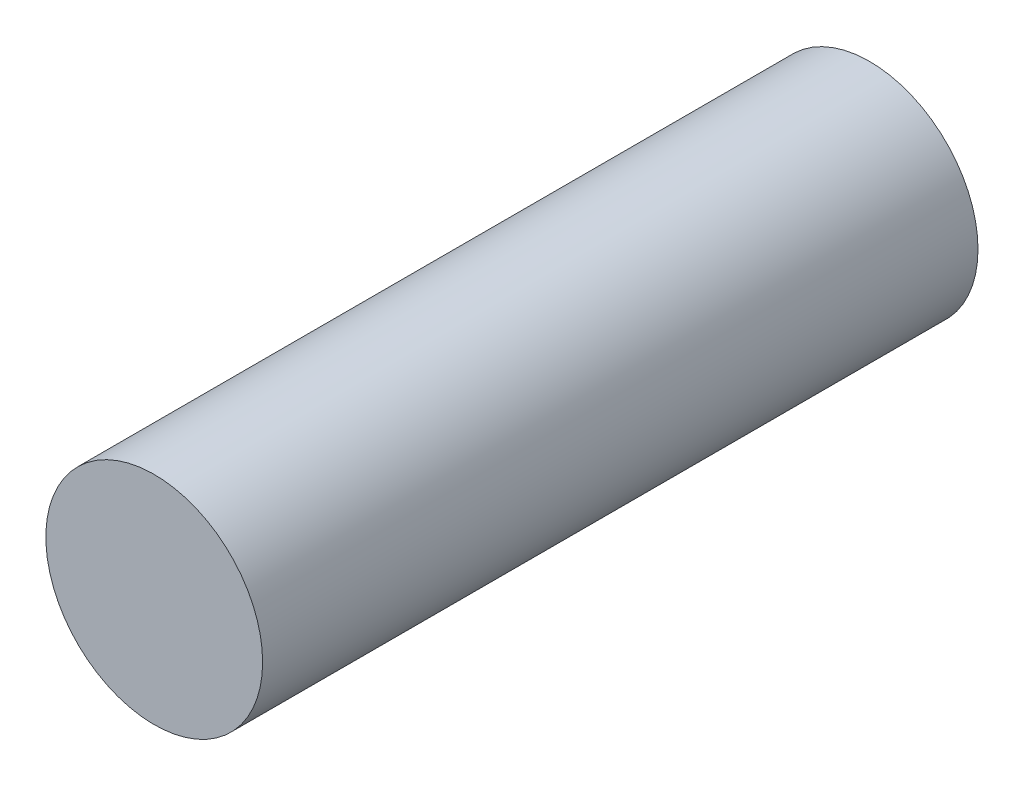
ISO-10303-21;
HEADER;
FILE_DESCRIPTION(('STEP AP214'),'2;1');
FILE_NAME('part.step','',(''),(''),'','','');
FILE_SCHEMA(('AUTOMOTIVE_DESIGN { 1 0 10303 214 1 1 1 1 }'));
ENDSEC;
DATA;
#1=APPLICATION_CONTEXT('core data for automotive mechanical design processes');
#2=APPLICATION_PROTOCOL_DEFINITION('international standard','automotive_design',2000,#1);
#3=PRODUCT_CONTEXT('',#1,'mechanical');
#4=PRODUCT('Part','Part','',(#3));
#5=PRODUCT_RELATED_PRODUCT_CATEGORY('part','',(#4));
#6=PRODUCT_DEFINITION_FORMATION('','',#4);
#7=PRODUCT_DEFINITION_CONTEXT('part definition',#1,'design');
#8=PRODUCT_DEFINITION('design','',#6,#7);
#9=PRODUCT_DEFINITION_SHAPE('','',#8);
#10=(LENGTH_UNIT() NAMED_UNIT(*) SI_UNIT(.MILLI.,.METRE.));
#11=(NAMED_UNIT(*) PLANE_ANGLE_UNIT() SI_UNIT($,.RADIAN.));
#12=(NAMED_UNIT(*) SI_UNIT($,.STERADIAN.) SOLID_ANGLE_UNIT());
#13=UNCERTAINTY_MEASURE_WITH_UNIT(LENGTH_MEASURE(1.E-05),#10,'distance_accuracy_value','');
#14=(GEOMETRIC_REPRESENTATION_CONTEXT(3) GLOBAL_UNCERTAINTY_ASSIGNED_CONTEXT((#13)) GLOBAL_UNIT_ASSIGNED_CONTEXT((#10,
#11,#12)) REPRESENTATION_CONTEXT('',''));
#15=CARTESIAN_POINT('',(0.,0.,0.));
#16=DIRECTION('',(0.,0.,1.));
#17=DIRECTION('',(1.,0.,0.));
#18=AXIS2_PLACEMENT_3D('',#15,#16,#17);
#19=CARTESIAN_POINT('',(0.,0.,19.8));
#20=DIRECTION('',(0.,0.,1.));
#21=DIRECTION('',(1.,0.,0.));
#22=AXIS2_PLACEMENT_3D('',#19,#20,#21);
#23=PLANE('',#22);
#24=CARTESIAN_POINT('',(0.,0.,19.8));
#25=DIRECTION('',(0.,0.,1.));
#26=DIRECTION('',(1.,0.,0.));
#27=AXIS2_PLACEMENT_3D('',#24,#25,#26);
#28=CIRCLE('',#27,3.);
#29=CARTESIAN_POINT('',(3.,0.,19.8));
#30=VERTEX_POINT('',#29);
#31=EDGE_CURVE('E11',#30,#30,#28,.T.);
#32=ORIENTED_EDGE('',*,*,#31,.T.);
#33=EDGE_LOOP('',(#32));
#34=FACE_BOUND('',#33,.T.);
#35=ADVANCED_FACE('F40',(#34),#23,.T.);
#36=CARTESIAN_POINT('',(0.,0.,41.0132034355964));
#37=DIRECTION('',(0.,0.,-1.));
#38=DIRECTION('',(-1.,0.,0.));
#39=AXIS2_PLACEMENT_3D('',#36,#37,#38);
#40=CYLINDRICAL_SURFACE('',#39,3.);
#41=ORIENTED_EDGE('',*,*,#31,.F.);
#42=EDGE_LOOP('',(#41));
#43=FACE_BOUND('',#42,.T.);
#44=CARTESIAN_POINT('',(0.,0.,0.));
#45=DIRECTION('',(0.,0.,1.));
#46=DIRECTION('',(1.,0.,0.));
#47=AXIS2_PLACEMENT_3D('',#44,#45,#46);
#48=CIRCLE('',#47,3.);
#49=CARTESIAN_POINT('',(3.,0.,0.));
#50=VERTEX_POINT('',#49);
#51=EDGE_CURVE('E44',#50,#50,#48,.T.);
#52=ORIENTED_EDGE('',*,*,#51,.T.);
#53=EDGE_LOOP('',(#52));
#54=FACE_BOUND('',#53,.T.);
#55=ADVANCED_FACE('F55',(#43,#54),#40,.T.);
#56=CARTESIAN_POINT('',(0.,0.,0.));
#57=DIRECTION('',(0.,0.,1.));
#58=DIRECTION('',(1.,0.,0.));
#59=AXIS2_PLACEMENT_3D('',#56,#57,#58);
#60=PLANE('',#59);
#61=ORIENTED_EDGE('',*,*,#51,.F.);
#62=EDGE_LOOP('',(#61));
#63=FACE_BOUND('',#62,.T.);
#64=ADVANCED_FACE('F42',(#63),#60,.F.);
#65=CLOSED_SHELL('',(#35,#55,#64));
#66=MANIFOLD_SOLID_BREP('B2',#65);
#67=ADVANCED_BREP_SHAPE_REPRESENTATION('',(#18,#66),#14);
#68=SHAPE_DEFINITION_REPRESENTATION(#9,#67);
ENDSEC;
END-ISO-10303-21;
